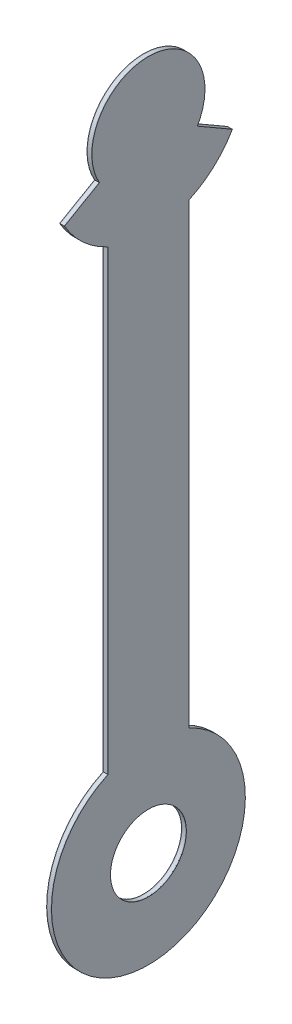
ISO-10303-21;
HEADER;
FILE_DESCRIPTION(('STEP AP214'),'2;1');
FILE_NAME('part.step','',(''),(''),'','','');
FILE_SCHEMA(('AUTOMOTIVE_DESIGN { 1 0 10303 214 1 1 1 1 }'));
ENDSEC;
DATA;
#1=APPLICATION_CONTEXT('core data for automotive mechanical design processes');
#2=APPLICATION_PROTOCOL_DEFINITION('international standard','automotive_design',2000,#1);
#3=PRODUCT_CONTEXT('',#1,'mechanical');
#4=PRODUCT('Part','Part','',(#3));
#5=PRODUCT_RELATED_PRODUCT_CATEGORY('part','',(#4));
#6=PRODUCT_DEFINITION_FORMATION('','',#4);
#7=PRODUCT_DEFINITION_CONTEXT('part definition',#1,'design');
#8=PRODUCT_DEFINITION('design','',#6,#7);
#9=PRODUCT_DEFINITION_SHAPE('','',#8);
#10=(LENGTH_UNIT() NAMED_UNIT(*) SI_UNIT(.MILLI.,.METRE.));
#11=(NAMED_UNIT(*) PLANE_ANGLE_UNIT() SI_UNIT($,.RADIAN.));
#12=(NAMED_UNIT(*) SI_UNIT($,.STERADIAN.) SOLID_ANGLE_UNIT());
#13=UNCERTAINTY_MEASURE_WITH_UNIT(LENGTH_MEASURE(1.E-05),#10,'distance_accuracy_value','');
#14=(GEOMETRIC_REPRESENTATION_CONTEXT(3) GLOBAL_UNCERTAINTY_ASSIGNED_CONTEXT((#13)) GLOBAL_UNIT_ASSIGNED_CONTEXT((#10,
#11,#12)) REPRESENTATION_CONTEXT('',''));
#15=CARTESIAN_POINT('',(0.,0.,0.));
#16=DIRECTION('',(0.,0.,1.));
#17=DIRECTION('',(1.,0.,0.));
#18=AXIS2_PLACEMENT_3D('',#15,#16,#17);
#19=CARTESIAN_POINT('',(-3.,0.,0.));
#20=DIRECTION('',(-1.,0.,0.));
#21=DIRECTION('',(0.,0.,1.));
#22=AXIS2_PLACEMENT_3D('',#19,#20,#21);
#23=PLANE('',#22);
#24=CARTESIAN_POINT('',(-3.,0.,0.));
#25=DIRECTION('',(-1.,0.,0.));
#26=DIRECTION('',(0.,0.,1.));
#27=AXIS2_PLACEMENT_3D('',#24,#25,#26);
#28=CIRCLE('',#27,60.);
#29=CARTESIAN_POINT('',(-3.,-54.5435605731786,25.));
#30=VERTEX_POINT('',#29);
#31=CARTESIAN_POINT('',(-3.,-29.9999999999997,51.9615242270665));
#32=VERTEX_POINT('',#31);
#33=EDGE_CURVE('E172',#30,#32,#28,.T.);
#34=ORIENTED_EDGE('',*,*,#33,.T.);
#35=DIRECTION('',(0.,0.5,-0.866025403784439));
#36=VECTOR('',#35,1.);
#37=CARTESIAN_POINT('',(-3.,-29.9999999999997,51.9615242270665));
#38=LINE('',#37,#36);
#39=CARTESIAN_POINT('',(-3.,-17.4999999999997,30.3108891324555));
#40=VERTEX_POINT('',#39);
#41=EDGE_CURVE('E120',#32,#40,#38,.T.);
#42=ORIENTED_EDGE('',*,*,#41,.T.);
#43=CARTESIAN_POINT('',(-3.,0.,0.));
#44=DIRECTION('',(-1.,0.,0.));
#45=DIRECTION('',(0.,0.,1.));
#46=AXIS2_PLACEMENT_3D('',#43,#44,#45);
#47=CIRCLE('',#46,35.);
#48=CARTESIAN_POINT('',(-3.,-17.5,-30.3108891324554));
#49=VERTEX_POINT('',#48);
#50=EDGE_CURVE('E187',#40,#49,#47,.T.);
#51=ORIENTED_EDGE('',*,*,#50,.T.);
#52=DIRECTION('',(0.,-0.500000000000001,-0.866025403784438));
#53=VECTOR('',#52,1.);
#54=CARTESIAN_POINT('',(-3.,-17.5,-30.3108891324553));
#55=LINE('',#54,#53);
#56=CARTESIAN_POINT('',(-3.,-30.0000000000001,-51.9615242270663));
#57=VERTEX_POINT('',#56);
#58=EDGE_CURVE('E200',#49,#57,#55,.T.);
#59=ORIENTED_EDGE('',*,*,#58,.T.);
#60=CARTESIAN_POINT('',(-3.,0.,0.));
#61=DIRECTION('',(-1.,0.,0.));
#62=DIRECTION('',(0.,0.,1.));
#63=AXIS2_PLACEMENT_3D('',#60,#61,#62);
#64=CIRCLE('',#63,60.);
#65=CARTESIAN_POINT('',(-3.,-54.5435605731786,-25.));
#66=VERTEX_POINT('',#65);
#67=EDGE_CURVE('E139',#57,#66,#64,.T.);
#68=ORIENTED_EDGE('',*,*,#67,.T.);
#69=DIRECTION('',(0.,-1.,0.));
#70=VECTOR('',#69,1.);
#71=CARTESIAN_POINT('',(-3.,-54.5435605731786,-25.));
#72=LINE('',#71,#70);
#73=CARTESIAN_POINT('',(-3.,-337.456439426821,-25.));
#74=VERTEX_POINT('',#73);
#75=EDGE_CURVE('E133',#66,#74,#72,.T.);
#76=ORIENTED_EDGE('',*,*,#75,.T.);
#77=CARTESIAN_POINT('',(-3.,-392.,0.));
#78=DIRECTION('',(-1.,0.,0.));
#79=DIRECTION('',(0.,0.,1.));
#80=AXIS2_PLACEMENT_3D('',#77,#78,#79);
#81=CIRCLE('',#80,60.);
#82=CARTESIAN_POINT('',(-3.,-337.456439426821,25.));
#83=VERTEX_POINT('',#82);
#84=EDGE_CURVE('E137',#74,#83,#81,.T.);
#85=ORIENTED_EDGE('',*,*,#84,.T.);
#86=DIRECTION('',(0.,1.,0.));
#87=VECTOR('',#86,1.);
#88=CARTESIAN_POINT('',(-3.,-337.456439426821,25.));
#89=LINE('',#88,#87);
#90=EDGE_CURVE('E77',#83,#30,#89,.T.);
#91=ORIENTED_EDGE('',*,*,#90,.T.);
#92=EDGE_LOOP('',(#34,#42,#51,#59,#68,#76,#85,#91));
#93=FACE_BOUND('',#92,.T.);
#94=CARTESIAN_POINT('',(-3.,-392.,0.));
#95=DIRECTION('',(-1.,0.,0.));
#96=DIRECTION('',(0.,0.,1.));
#97=AXIS2_PLACEMENT_3D('',#94,#95,#96);
#98=CIRCLE('',#97,23.5);
#99=CARTESIAN_POINT('',(-3.,-392.,23.5));
#100=VERTEX_POINT('',#99);
#101=EDGE_CURVE('E161',#100,#100,#98,.T.);
#102=ORIENTED_EDGE('',*,*,#101,.F.);
#103=EDGE_LOOP('',(#102));
#104=FACE_BOUND('',#103,.T.);
#105=ADVANCED_FACE('F60',(#93,#104),#23,.T.);
#106=CARTESIAN_POINT('',(-2.75,0.,0.));
#107=DIRECTION('',(-1.,0.,0.));
#108=DIRECTION('',(0.,0.,1.));
#109=AXIS2_PLACEMENT_3D('',#106,#107,#108);
#110=PLANE('',#109);
#111=CARTESIAN_POINT('',(-2.75,0.,0.));
#112=DIRECTION('',(-1.,0.,0.));
#113=DIRECTION('',(0.,0.,1.));
#114=AXIS2_PLACEMENT_3D('',#111,#112,#113);
#115=CIRCLE('',#114,60.);
#116=CARTESIAN_POINT('',(-2.75,-54.5435605731786,25.));
#117=VERTEX_POINT('',#116);
#118=CARTESIAN_POINT('',(-2.75,-29.9999999999997,51.9615242270665));
#119=VERTEX_POINT('',#118);
#120=EDGE_CURVE('E157',#117,#119,#115,.T.);
#121=ORIENTED_EDGE('',*,*,#120,.F.);
#122=DIRECTION('',(0.,1.,0.));
#123=VECTOR('',#122,1.);
#124=CARTESIAN_POINT('',(-2.75,-337.456439426821,25.));
#125=LINE('',#124,#123);
#126=CARTESIAN_POINT('',(-2.75,-337.456439426821,25.));
#127=VERTEX_POINT('',#126);
#128=EDGE_CURVE('E112',#127,#117,#125,.T.);
#129=ORIENTED_EDGE('',*,*,#128,.F.);
#130=CARTESIAN_POINT('',(-2.75,-392.,0.));
#131=DIRECTION('',(-1.,0.,0.));
#132=DIRECTION('',(0.,0.,1.));
#133=AXIS2_PLACEMENT_3D('',#130,#131,#132);
#134=CIRCLE('',#133,60.);
#135=CARTESIAN_POINT('',(-2.75,-337.456439426821,-25.));
#136=VERTEX_POINT('',#135);
#137=EDGE_CURVE('E106',#136,#127,#134,.T.);
#138=ORIENTED_EDGE('',*,*,#137,.F.);
#139=DIRECTION('',(0.,-1.,0.));
#140=VECTOR('',#139,1.);
#141=CARTESIAN_POINT('',(-2.75,-54.5435605731786,-25.));
#142=LINE('',#141,#140);
#143=CARTESIAN_POINT('',(-2.75,-54.5435605731786,-25.));
#144=VERTEX_POINT('',#143);
#145=EDGE_CURVE('E147',#144,#136,#142,.T.);
#146=ORIENTED_EDGE('',*,*,#145,.F.);
#147=CARTESIAN_POINT('',(-2.75,0.,0.));
#148=DIRECTION('',(-1.,0.,0.));
#149=DIRECTION('',(0.,0.,1.));
#150=AXIS2_PLACEMENT_3D('',#147,#148,#149);
#151=CIRCLE('',#150,60.);
#152=CARTESIAN_POINT('',(-2.75,-30.0000000000001,-51.9615242270663));
#153=VERTEX_POINT('',#152);
#154=EDGE_CURVE('E167',#153,#144,#151,.T.);
#155=ORIENTED_EDGE('',*,*,#154,.F.);
#156=DIRECTION('',(0.,-0.500000000000001,-0.866025403784438));
#157=VECTOR('',#156,1.);
#158=CARTESIAN_POINT('',(-2.75,-17.5,-30.3108891324553));
#159=LINE('',#158,#157);
#160=CARTESIAN_POINT('',(-2.75,-17.5,-30.3108891324554));
#161=VERTEX_POINT('',#160);
#162=EDGE_CURVE('E165',#161,#153,#159,.T.);
#163=ORIENTED_EDGE('',*,*,#162,.F.);
#164=CARTESIAN_POINT('',(-2.75,0.,0.));
#165=DIRECTION('',(-1.,0.,0.));
#166=DIRECTION('',(0.,0.,1.));
#167=AXIS2_PLACEMENT_3D('',#164,#165,#166);
#168=CIRCLE('',#167,35.);
#169=CARTESIAN_POINT('',(-2.75,-17.4999999999997,30.3108891324555));
#170=VERTEX_POINT('',#169);
#171=EDGE_CURVE('E163',#170,#161,#168,.T.);
#172=ORIENTED_EDGE('',*,*,#171,.F.);
#173=DIRECTION('',(0.,0.5,-0.866025403784439));
#174=VECTOR('',#173,1.);
#175=CARTESIAN_POINT('',(-2.75,-29.9999999999997,51.9615242270665));
#176=LINE('',#175,#174);
#177=EDGE_CURVE('E160',#119,#170,#176,.T.);
#178=ORIENTED_EDGE('',*,*,#177,.F.);
#179=EDGE_LOOP('',(#121,#129,#138,#146,#155,#163,#172,#178));
#180=FACE_BOUND('',#179,.T.);
#181=CARTESIAN_POINT('',(-2.75,-392.,0.));
#182=DIRECTION('',(-1.,0.,0.));
#183=DIRECTION('',(0.,0.,1.));
#184=AXIS2_PLACEMENT_3D('',#181,#182,#183);
#185=CIRCLE('',#184,23.5);
#186=CARTESIAN_POINT('',(-2.75,-392.,23.5));
#187=VERTEX_POINT('',#186);
#188=EDGE_CURVE('E206',#187,#187,#185,.T.);
#189=ORIENTED_EDGE('',*,*,#188,.T.);
#190=EDGE_LOOP('',(#189));
#191=FACE_BOUND('',#190,.T.);
#192=ADVANCED_FACE('F191',(#180,#191),#110,.F.);
#193=CARTESIAN_POINT('',(-3.,0.,0.));
#194=DIRECTION('',(1.,0.,0.));
#195=DIRECTION('',(0.,0.,-1.));
#196=AXIS2_PLACEMENT_3D('',#193,#194,#195);
#197=CYLINDRICAL_SURFACE('',#196,60.);
#198=ORIENTED_EDGE('',*,*,#120,.T.);
#199=DIRECTION('',(1.,0.,0.));
#200=VECTOR('',#199,1.);
#201=CARTESIAN_POINT('',(-3.,-29.9999999999997,51.9615242270665));
#202=LINE('',#201,#200);
#203=EDGE_CURVE('E12',#32,#119,#202,.T.);
#204=ORIENTED_EDGE('',*,*,#203,.F.);
#205=ORIENTED_EDGE('',*,*,#33,.F.);
#206=DIRECTION('',(1.,0.,0.));
#207=VECTOR('',#206,1.);
#208=CARTESIAN_POINT('',(-3.,-54.5435605731786,25.));
#209=LINE('',#208,#207);
#210=EDGE_CURVE('E153',#30,#117,#209,.T.);
#211=ORIENTED_EDGE('',*,*,#210,.T.);
#212=EDGE_LOOP('',(#198,#204,#205,#211));
#213=FACE_BOUND('',#212,.T.);
#214=ADVANCED_FACE('F62',(#213),#197,.T.);
#215=CARTESIAN_POINT('',(-3.,-29.9999999999997,51.9615242270665));
#216=DIRECTION('',(0.,-0.866025403784439,-0.5));
#217=DIRECTION('',(0.,0.5,-0.866025403784439));
#218=AXIS2_PLACEMENT_3D('',#215,#216,#217);
#219=PLANE('',#218);
#220=ORIENTED_EDGE('',*,*,#177,.T.);
#221=DIRECTION('',(1.,0.,0.));
#222=VECTOR('',#221,1.);
#223=CARTESIAN_POINT('',(-3.,-17.4999999999997,30.3108891324555));
#224=LINE('',#223,#222);
#225=EDGE_CURVE('E69',#40,#170,#224,.T.);
#226=ORIENTED_EDGE('',*,*,#225,.F.);
#227=ORIENTED_EDGE('',*,*,#41,.F.);
#228=ORIENTED_EDGE('',*,*,#203,.T.);
#229=EDGE_LOOP('',(#220,#226,#227,#228));
#230=FACE_BOUND('',#229,.T.);
#231=ADVANCED_FACE('F234',(#230),#219,.F.);
#232=CARTESIAN_POINT('',(-3.,0.,0.));
#233=DIRECTION('',(1.,0.,0.));
#234=DIRECTION('',(0.,0.,-1.));
#235=AXIS2_PLACEMENT_3D('',#232,#233,#234);
#236=CYLINDRICAL_SURFACE('',#235,35.);
#237=ORIENTED_EDGE('',*,*,#171,.T.);
#238=DIRECTION('',(1.,0.,0.));
#239=VECTOR('',#238,1.);
#240=CARTESIAN_POINT('',(-3.,-17.5,-30.3108891324554));
#241=LINE('',#240,#239);
#242=EDGE_CURVE('E179',#49,#161,#241,.T.);
#243=ORIENTED_EDGE('',*,*,#242,.F.);
#244=ORIENTED_EDGE('',*,*,#50,.F.);
#245=ORIENTED_EDGE('',*,*,#225,.T.);
#246=EDGE_LOOP('',(#237,#243,#244,#245));
#247=FACE_BOUND('',#246,.T.);
#248=ADVANCED_FACE('F185',(#247),#236,.T.);
#249=CARTESIAN_POINT('',(-3.,-17.5,-30.3108891324553));
#250=DIRECTION('',(0.,-0.866025403784438,0.500000000000001));
#251=DIRECTION('',(0.,-0.500000000000001,-0.866025403784438));
#252=AXIS2_PLACEMENT_3D('',#249,#250,#251);
#253=PLANE('',#252);
#254=ORIENTED_EDGE('',*,*,#162,.T.);
#255=DIRECTION('',(1.,0.,0.));
#256=VECTOR('',#255,1.);
#257=CARTESIAN_POINT('',(-3.,-30.0000000000001,-51.9615242270663));
#258=LINE('',#257,#256);
#259=EDGE_CURVE('E176',#57,#153,#258,.T.);
#260=ORIENTED_EDGE('',*,*,#259,.F.);
#261=ORIENTED_EDGE('',*,*,#58,.F.);
#262=ORIENTED_EDGE('',*,*,#242,.T.);
#263=EDGE_LOOP('',(#254,#260,#261,#262));
#264=FACE_BOUND('',#263,.T.);
#265=ADVANCED_FACE('F196',(#264),#253,.F.);
#266=CARTESIAN_POINT('',(-3.,0.,0.));
#267=DIRECTION('',(1.,0.,0.));
#268=DIRECTION('',(0.,0.,-1.));
#269=AXIS2_PLACEMENT_3D('',#266,#267,#268);
#270=CYLINDRICAL_SURFACE('',#269,60.);
#271=ORIENTED_EDGE('',*,*,#154,.T.);
#272=DIRECTION('',(1.,0.,0.));
#273=VECTOR('',#272,1.);
#274=CARTESIAN_POINT('',(-3.,-54.5435605731786,-25.));
#275=LINE('',#274,#273);
#276=EDGE_CURVE('E148',#66,#144,#275,.T.);
#277=ORIENTED_EDGE('',*,*,#276,.F.);
#278=ORIENTED_EDGE('',*,*,#67,.F.);
#279=ORIENTED_EDGE('',*,*,#259,.T.);
#280=EDGE_LOOP('',(#271,#277,#278,#279));
#281=FACE_BOUND('',#280,.T.);
#282=ADVANCED_FACE('F199',(#281),#270,.T.);
#283=CARTESIAN_POINT('',(-3.,-54.5435605731786,-25.));
#284=DIRECTION('',(0.,0.,1.));
#285=DIRECTION('',(0.,-1.,0.));
#286=AXIS2_PLACEMENT_3D('',#283,#284,#285);
#287=PLANE('',#286);
#288=ORIENTED_EDGE('',*,*,#145,.T.);
#289=DIRECTION('',(1.,0.,0.));
#290=VECTOR('',#289,1.);
#291=CARTESIAN_POINT('',(-3.,-337.456439426821,-25.));
#292=LINE('',#291,#290);
#293=EDGE_CURVE('E144',#74,#136,#292,.T.);
#294=ORIENTED_EDGE('',*,*,#293,.F.);
#295=ORIENTED_EDGE('',*,*,#75,.F.);
#296=ORIENTED_EDGE('',*,*,#276,.T.);
#297=EDGE_LOOP('',(#288,#294,#295,#296));
#298=FACE_BOUND('',#297,.T.);
#299=ADVANCED_FACE('F145',(#298),#287,.F.);
#300=CARTESIAN_POINT('',(-3.,-392.,0.));
#301=DIRECTION('',(1.,0.,0.));
#302=DIRECTION('',(0.,0.,-1.));
#303=AXIS2_PLACEMENT_3D('',#300,#301,#302);
#304=CYLINDRICAL_SURFACE('',#303,60.);
#305=ORIENTED_EDGE('',*,*,#137,.T.);
#306=DIRECTION('',(1.,0.,0.));
#307=VECTOR('',#306,1.);
#308=CARTESIAN_POINT('',(-3.,-337.456439426821,25.));
#309=LINE('',#308,#307);
#310=EDGE_CURVE('E149',#83,#127,#309,.T.);
#311=ORIENTED_EDGE('',*,*,#310,.F.);
#312=ORIENTED_EDGE('',*,*,#84,.F.);
#313=ORIENTED_EDGE('',*,*,#293,.T.);
#314=EDGE_LOOP('',(#305,#311,#312,#313));
#315=FACE_BOUND('',#314,.T.);
#316=ADVANCED_FACE('F151',(#315),#304,.T.);
#317=CARTESIAN_POINT('',(-3.,-337.456439426821,25.));
#318=DIRECTION('',(0.,0.,-1.));
#319=DIRECTION('',(0.,1.,0.));
#320=AXIS2_PLACEMENT_3D('',#317,#318,#319);
#321=PLANE('',#320);
#322=ORIENTED_EDGE('',*,*,#128,.T.);
#323=ORIENTED_EDGE('',*,*,#210,.F.);
#324=ORIENTED_EDGE('',*,*,#90,.F.);
#325=ORIENTED_EDGE('',*,*,#310,.T.);
#326=EDGE_LOOP('',(#322,#323,#324,#325));
#327=FACE_BOUND('',#326,.T.);
#328=ADVANCED_FACE('F222',(#327),#321,.F.);
#329=CARTESIAN_POINT('',(-3.,-392.,0.));
#330=DIRECTION('',(1.,0.,0.));
#331=DIRECTION('',(0.,0.,-1.));
#332=AXIS2_PLACEMENT_3D('',#329,#330,#331);
#333=CYLINDRICAL_SURFACE('',#332,23.5);
#334=ORIENTED_EDGE('',*,*,#101,.T.);
#335=EDGE_LOOP('',(#334));
#336=FACE_BOUND('',#335,.T.);
#337=ORIENTED_EDGE('',*,*,#188,.F.);
#338=EDGE_LOOP('',(#337));
#339=FACE_BOUND('',#338,.T.);
#340=ADVANCED_FACE('F212',(#336,#339),#333,.F.);
#341=CLOSED_SHELL('',(#105,#192,#214,#231,#248,#265,#282,#299,#316,#328,#340));
#342=MANIFOLD_SOLID_BREP('B2',#341);
#343=CARTESIAN_POINT('',(-2.75,2.98960605148695E-13,1.72604985859692E-13));
#344=DIRECTION('',(0.,-0.866025403784439,-0.5));
#345=DIRECTION('',(0.,0.5,-0.866025403784439));
#346=AXIS2_PLACEMENT_3D('',#343,#344,#345);
#347=PLANE('',#346);
#348=DIRECTION('',(0.,0.5,-0.866025403784439));
#349=VECTOR('',#348,1.);
#350=CARTESIAN_POINT('',(-0.25,2.98960605148695E-13,1.72604985859692E-13));
#351=LINE('',#350,#349);
#352=CARTESIAN_POINT('',(-0.25,-29.9999999999997,51.9615242270665));
#353=VERTEX_POINT('',#352);
#354=CARTESIAN_POINT('',(-0.25,-17.4999999999997,30.3108891324555));
#355=VERTEX_POINT('',#354);
#356=EDGE_CURVE('E424',#353,#355,#351,.T.);
#357=ORIENTED_EDGE('',*,*,#356,.T.);
#358=DIRECTION('',(1.,0.,0.));
#359=VECTOR('',#358,1.);
#360=CARTESIAN_POINT('',(-2.75,-17.4999999999997,30.3108891324555));
#361=LINE('',#360,#359);
#362=CARTESIAN_POINT('',(-2.75,-17.4999999999997,30.3108891324555));
#363=VERTEX_POINT('',#362);
#364=EDGE_CURVE('E58',#363,#355,#361,.T.);
#365=ORIENTED_EDGE('',*,*,#364,.F.);
#366=DIRECTION('',(0.,0.5,-0.866025403784439));
#367=VECTOR('',#366,1.);
#368=CARTESIAN_POINT('',(-2.75,2.98960605148695E-13,1.72604985859692E-13));
#369=LINE('',#368,#367);
#370=CARTESIAN_POINT('',(-2.75,-29.9999999999997,51.9615242270665));
#371=VERTEX_POINT('',#370);
#372=EDGE_CURVE('E488',#371,#363,#369,.T.);
#373=ORIENTED_EDGE('',*,*,#372,.F.);
#374=DIRECTION('',(1.,0.,0.));
#375=VECTOR('',#374,1.);
#376=CARTESIAN_POINT('',(-2.75,-29.9999999999997,51.9615242270665));
#377=LINE('',#376,#375);
#378=EDGE_CURVE('E416',#371,#353,#377,.T.);
#379=ORIENTED_EDGE('',*,*,#378,.T.);
#380=EDGE_LOOP('',(#357,#365,#373,#379));
#381=FACE_BOUND('',#380,.T.);
#382=ADVANCED_FACE('F318',(#381),#347,.F.);
#383=CARTESIAN_POINT('',(-2.75,0.,0.));
#384=DIRECTION('',(1.,0.,0.));
#385=DIRECTION('',(0.,0.,-1.));
#386=AXIS2_PLACEMENT_3D('',#383,#384,#385);
#387=CYLINDRICAL_SURFACE('',#386,35.);
#388=CARTESIAN_POINT('',(-0.25,0.,0.));
#389=DIRECTION('',(-1.,0.,0.));
#390=DIRECTION('',(0.,0.,1.));
#391=AXIS2_PLACEMENT_3D('',#388,#389,#390);
#392=CIRCLE('',#391,35.);
#393=CARTESIAN_POINT('',(-0.25,-17.5,-30.3108891324553));
#394=VERTEX_POINT('',#393);
#395=EDGE_CURVE('E428',#355,#394,#392,.T.);
#396=ORIENTED_EDGE('',*,*,#395,.T.);
#397=DIRECTION('',(1.,0.,0.));
#398=VECTOR('',#397,1.);
#399=CARTESIAN_POINT('',(-2.75,-17.5,-30.3108891324553));
#400=LINE('',#399,#398);
#401=CARTESIAN_POINT('',(-2.75,-17.5,-30.3108891324553));
#402=VERTEX_POINT('',#401);
#403=EDGE_CURVE('E328',#402,#394,#400,.T.);
#404=ORIENTED_EDGE('',*,*,#403,.F.);
#405=CARTESIAN_POINT('',(-2.75,0.,0.));
#406=DIRECTION('',(-1.,0.,0.));
#407=DIRECTION('',(0.,0.,1.));
#408=AXIS2_PLACEMENT_3D('',#405,#406,#407);
#409=CIRCLE('',#408,35.);
#410=EDGE_CURVE('E379',#363,#402,#409,.T.);
#411=ORIENTED_EDGE('',*,*,#410,.F.);
#412=ORIENTED_EDGE('',*,*,#364,.T.);
#413=EDGE_LOOP('',(#396,#404,#411,#412));
#414=FACE_BOUND('',#413,.T.);
#415=ADVANCED_FACE('F509',(#414),#387,.T.);
#416=CARTESIAN_POINT('',(-2.75,0.,0.));
#417=DIRECTION('',(0.,-0.866025403784438,0.500000000000001));
#418=DIRECTION('',(0.,-0.500000000000001,-0.866025403784438));
#419=AXIS2_PLACEMENT_3D('',#416,#417,#418);
#420=PLANE('',#419);
#421=DIRECTION('',(0.,-0.500000000000001,-0.866025403784438));
#422=VECTOR('',#421,1.);
#423=CARTESIAN_POINT('',(-0.25,0.,0.));
#424=LINE('',#423,#422);
#425=CARTESIAN_POINT('',(-0.25,-30.0000000000001,-51.9615242270663));
#426=VERTEX_POINT('',#425);
#427=EDGE_CURVE('E431',#394,#426,#424,.T.);
#428=ORIENTED_EDGE('',*,*,#427,.T.);
#429=DIRECTION('',(1.,0.,0.));
#430=VECTOR('',#429,1.);
#431=CARTESIAN_POINT('',(-2.75,-30.0000000000001,-51.9615242270663));
#432=LINE('',#431,#430);
#433=CARTESIAN_POINT('',(-2.75,-30.0000000000001,-51.9615242270663));
#434=VERTEX_POINT('',#433);
#435=EDGE_CURVE('E457',#434,#426,#432,.T.);
#436=ORIENTED_EDGE('',*,*,#435,.F.);
#437=DIRECTION('',(0.,-0.500000000000001,-0.866025403784438));
#438=VECTOR('',#437,1.);
#439=CARTESIAN_POINT('',(-2.75,0.,0.));
#440=LINE('',#439,#438);
#441=EDGE_CURVE('E467',#402,#434,#440,.T.);
#442=ORIENTED_EDGE('',*,*,#441,.F.);
#443=ORIENTED_EDGE('',*,*,#403,.T.);
#444=EDGE_LOOP('',(#428,#436,#442,#443));
#445=FACE_BOUND('',#444,.T.);
#446=ADVANCED_FACE('F465',(#445),#420,.F.);
#447=CARTESIAN_POINT('',(-2.75,0.,0.));
#448=DIRECTION('',(1.,0.,0.));
#449=DIRECTION('',(0.,0.,-1.));
#450=AXIS2_PLACEMENT_3D('',#447,#448,#449);
#451=CYLINDRICAL_SURFACE('',#450,60.);
#452=CARTESIAN_POINT('',(-0.25,0.,0.));
#453=DIRECTION('',(-1.,0.,0.));
#454=DIRECTION('',(0.,0.,1.));
#455=AXIS2_PLACEMENT_3D('',#452,#453,#454);
#456=CIRCLE('',#455,60.);
#457=CARTESIAN_POINT('',(-0.25,-54.5435605731786,-25.));
#458=VERTEX_POINT('',#457);
#459=EDGE_CURVE('E434',#426,#458,#456,.T.);
#460=ORIENTED_EDGE('',*,*,#459,.T.);
#461=DIRECTION('',(1.,0.,0.));
#462=VECTOR('',#461,1.);
#463=CARTESIAN_POINT('',(-2.75,-54.5435605731786,-25.));
#464=LINE('',#463,#462);
#465=CARTESIAN_POINT('',(-2.75,-54.5435605731786,-25.));
#466=VERTEX_POINT('',#465);
#467=EDGE_CURVE('E453',#466,#458,#464,.T.);
#468=ORIENTED_EDGE('',*,*,#467,.F.);
#469=CARTESIAN_POINT('',(-2.75,0.,0.));
#470=DIRECTION('',(-1.,0.,0.));
#471=DIRECTION('',(0.,0.,1.));
#472=AXIS2_PLACEMENT_3D('',#469,#470,#471);
#473=CIRCLE('',#472,60.);
#474=EDGE_CURVE('E480',#434,#466,#473,.T.);
#475=ORIENTED_EDGE('',*,*,#474,.F.);
#476=ORIENTED_EDGE('',*,*,#435,.T.);
#477=EDGE_LOOP('',(#460,#468,#475,#476));
#478=FACE_BOUND('',#477,.T.);
#479=ADVANCED_FACE('F475',(#478),#451,.T.);
#480=CARTESIAN_POINT('',(-2.75,0.,-25.));
#481=DIRECTION('',(0.,0.,1.));
#482=DIRECTION('',(1.,0.,0.));
#483=AXIS2_PLACEMENT_3D('',#480,#481,#482);
#484=PLANE('',#483);
#485=DIRECTION('',(0.,-1.,0.));
#486=VECTOR('',#485,1.);
#487=CARTESIAN_POINT('',(-0.25,0.,-25.));
#488=LINE('',#487,#486);
#489=CARTESIAN_POINT('',(-0.25,-337.456439426821,-25.));
#490=VERTEX_POINT('',#489);
#491=EDGE_CURVE('E437',#458,#490,#488,.T.);
#492=ORIENTED_EDGE('',*,*,#491,.T.);
#493=DIRECTION('',(1.,0.,0.));
#494=VECTOR('',#493,1.);
#495=CARTESIAN_POINT('',(-2.75,-337.456439426821,-25.));
#496=LINE('',#495,#494);
#497=CARTESIAN_POINT('',(-2.75,-337.456439426821,-25.));
#498=VERTEX_POINT('',#497);
#499=EDGE_CURVE('E409',#498,#490,#496,.T.);
#500=ORIENTED_EDGE('',*,*,#499,.F.);
#501=DIRECTION('',(0.,-1.,0.));
#502=VECTOR('',#501,1.);
#503=CARTESIAN_POINT('',(-2.75,0.,-25.));
#504=LINE('',#503,#502);
#505=EDGE_CURVE('E398',#466,#498,#504,.T.);
#506=ORIENTED_EDGE('',*,*,#505,.F.);
#507=ORIENTED_EDGE('',*,*,#467,.T.);
#508=EDGE_LOOP('',(#492,#500,#506,#507));
#509=FACE_BOUND('',#508,.T.);
#510=ADVANCED_FACE('F478',(#509),#484,.F.);
#511=CARTESIAN_POINT('',(-2.75,-392.,0.));
#512=DIRECTION('',(1.,0.,0.));
#513=DIRECTION('',(0.,0.,-1.));
#514=AXIS2_PLACEMENT_3D('',#511,#512,#513);
#515=CYLINDRICAL_SURFACE('',#514,60.);
#516=CARTESIAN_POINT('',(-0.25,-392.,0.));
#517=DIRECTION('',(-1.,0.,0.));
#518=DIRECTION('',(0.,0.,1.));
#519=AXIS2_PLACEMENT_3D('',#516,#517,#518);
#520=CIRCLE('',#519,60.);
#521=CARTESIAN_POINT('',(-0.25,-337.456439426821,25.));
#522=VERTEX_POINT('',#521);
#523=EDGE_CURVE('E407',#490,#522,#520,.T.);
#524=ORIENTED_EDGE('',*,*,#523,.T.);
#525=DIRECTION('',(1.,0.,0.));
#526=VECTOR('',#525,1.);
#527=CARTESIAN_POINT('',(-2.75,-337.456439426821,25.));
#528=LINE('',#527,#526);
#529=CARTESIAN_POINT('',(-2.75,-337.456439426821,25.));
#530=VERTEX_POINT('',#529);
#531=EDGE_CURVE('E404',#530,#522,#528,.T.);
#532=ORIENTED_EDGE('',*,*,#531,.F.);
#533=CARTESIAN_POINT('',(-2.75,-392.,0.));
#534=DIRECTION('',(-1.,0.,0.));
#535=DIRECTION('',(0.,0.,1.));
#536=AXIS2_PLACEMENT_3D('',#533,#534,#535);
#537=CIRCLE('',#536,60.);
#538=EDGE_CURVE('E392',#498,#530,#537,.T.);
#539=ORIENTED_EDGE('',*,*,#538,.F.);
#540=ORIENTED_EDGE('',*,*,#499,.T.);
#541=EDGE_LOOP('',(#524,#532,#539,#540));
#542=FACE_BOUND('',#541,.T.);
#543=ADVANCED_FACE('F405',(#542),#515,.T.);
#544=CARTESIAN_POINT('',(-2.75,0.,25.));
#545=DIRECTION('',(0.,0.,-1.));
#546=DIRECTION('',(-1.,0.,0.));
#547=AXIS2_PLACEMENT_3D('',#544,#545,#546);
#548=PLANE('',#547);
#549=DIRECTION('',(0.,1.,0.));
#550=VECTOR('',#549,1.);
#551=CARTESIAN_POINT('',(-0.25,0.,25.));
#552=LINE('',#551,#550);
#553=CARTESIAN_POINT('',(-0.25,-54.5435605731786,25.));
#554=VERTEX_POINT('',#553);
#555=EDGE_CURVE('E365',#522,#554,#552,.T.);
#556=ORIENTED_EDGE('',*,*,#555,.T.);
#557=DIRECTION('',(1.,0.,0.));
#558=VECTOR('',#557,1.);
#559=CARTESIAN_POINT('',(-2.75,-54.5435605731786,25.));
#560=LINE('',#559,#558);
#561=CARTESIAN_POINT('',(-2.75,-54.5435605731786,25.));
#562=VERTEX_POINT('',#561);
#563=EDGE_CURVE('E410',#562,#554,#560,.T.);
#564=ORIENTED_EDGE('',*,*,#563,.F.);
#565=DIRECTION('',(0.,1.,0.));
#566=VECTOR('',#565,1.);
#567=CARTESIAN_POINT('',(-2.75,0.,25.));
#568=LINE('',#567,#566);
#569=EDGE_CURVE('E396',#530,#562,#568,.T.);
#570=ORIENTED_EDGE('',*,*,#569,.F.);
#571=ORIENTED_EDGE('',*,*,#531,.T.);
#572=EDGE_LOOP('',(#556,#564,#570,#571));
#573=FACE_BOUND('',#572,.T.);
#574=ADVANCED_FACE('F412',(#573),#548,.F.);
#575=CARTESIAN_POINT('',(-2.75,-392.,0.));
#576=DIRECTION('',(1.,0.,0.));
#577=DIRECTION('',(0.,0.,-1.));
#578=AXIS2_PLACEMENT_3D('',#575,#576,#577);
#579=CYLINDRICAL_SURFACE('',#578,23.5);
#580=CARTESIAN_POINT('',(-2.75,-392.,0.));
#581=DIRECTION('',(-1.,0.,0.));
#582=DIRECTION('',(0.,0.,1.));
#583=AXIS2_PLACEMENT_3D('',#580,#581,#582);
#584=CIRCLE('',#583,23.5);
#585=CARTESIAN_POINT('',(-2.75,-392.,23.5));
#586=VERTEX_POINT('',#585);
#587=EDGE_CURVE('E446',#586,#586,#584,.F.);
#588=ORIENTED_EDGE('',*,*,#587,.F.);
#589=EDGE_LOOP('',(#588));
#590=FACE_BOUND('',#589,.T.);
#591=CARTESIAN_POINT('',(-0.25,-392.,0.));
#592=DIRECTION('',(-1.,0.,0.));
#593=DIRECTION('',(0.,0.,1.));
#594=AXIS2_PLACEMENT_3D('',#591,#592,#593);
#595=CIRCLE('',#594,23.5);
#596=CARTESIAN_POINT('',(-0.25,-392.,23.5));
#597=VERTEX_POINT('',#596);
#598=EDGE_CURVE('E420',#597,#597,#595,.F.);
#599=ORIENTED_EDGE('',*,*,#598,.T.);
#600=EDGE_LOOP('',(#599));
#601=FACE_BOUND('',#600,.T.);
#602=ADVANCED_FACE('F320',(#590,#601),#579,.F.);
#603=CARTESIAN_POINT('',(-2.75,0.,0.));
#604=DIRECTION('',(1.,0.,0.));
#605=DIRECTION('',(0.,0.,-1.));
#606=AXIS2_PLACEMENT_3D('',#603,#604,#605);
#607=CYLINDRICAL_SURFACE('',#606,60.);
#608=CARTESIAN_POINT('',(-0.25,0.,0.));
#609=DIRECTION('',(-1.,0.,0.));
#610=DIRECTION('',(0.,0.,1.));
#611=AXIS2_PLACEMENT_3D('',#608,#609,#610);
#612=CIRCLE('',#611,60.);
#613=EDGE_CURVE('E371',#554,#353,#612,.T.);
#614=ORIENTED_EDGE('',*,*,#613,.T.);
#615=ORIENTED_EDGE('',*,*,#378,.F.);
#616=CARTESIAN_POINT('',(-2.75,0.,0.));
#617=DIRECTION('',(-1.,0.,0.));
#618=DIRECTION('',(0.,0.,1.));
#619=AXIS2_PLACEMENT_3D('',#616,#617,#618);
#620=CIRCLE('',#619,60.);
#621=EDGE_CURVE('E336',#562,#371,#620,.T.);
#622=ORIENTED_EDGE('',*,*,#621,.F.);
#623=ORIENTED_EDGE('',*,*,#563,.T.);
#624=EDGE_LOOP('',(#614,#615,#622,#623));
#625=FACE_BOUND('',#624,.T.);
#626=ADVANCED_FACE('F498',(#625),#607,.T.);
#627=CARTESIAN_POINT('',(-2.75,0.,0.));
#628=DIRECTION('',(-1.,0.,0.));
#629=DIRECTION('',(0.,0.,1.));
#630=AXIS2_PLACEMENT_3D('',#627,#628,#629);
#631=PLANE('',#630);
#632=ORIENTED_EDGE('',*,*,#587,.T.);
#633=EDGE_LOOP('',(#632));
#634=FACE_BOUND('',#633,.T.);
#635=ORIENTED_EDGE('',*,*,#372,.T.);
#636=ORIENTED_EDGE('',*,*,#410,.T.);
#637=ORIENTED_EDGE('',*,*,#441,.T.);
#638=ORIENTED_EDGE('',*,*,#474,.T.);
#639=ORIENTED_EDGE('',*,*,#505,.T.);
#640=ORIENTED_EDGE('',*,*,#538,.T.);
#641=ORIENTED_EDGE('',*,*,#569,.T.);
#642=ORIENTED_EDGE('',*,*,#621,.T.);
#643=EDGE_LOOP('',(#635,#636,#637,#638,#639,#640,#641,#642));
#644=FACE_BOUND('',#643,.T.);
#645=ADVANCED_FACE('F394',(#634,#644),#631,.T.);
#646=CARTESIAN_POINT('',(-0.25,0.,0.));
#647=DIRECTION('',(-1.,0.,0.));
#648=DIRECTION('',(0.,0.,1.));
#649=AXIS2_PLACEMENT_3D('',#646,#647,#648);
#650=PLANE('',#649);
#651=ORIENTED_EDGE('',*,*,#598,.F.);
#652=EDGE_LOOP('',(#651));
#653=FACE_BOUND('',#652,.T.);
#654=ORIENTED_EDGE('',*,*,#356,.F.);
#655=ORIENTED_EDGE('',*,*,#613,.F.);
#656=ORIENTED_EDGE('',*,*,#555,.F.);
#657=ORIENTED_EDGE('',*,*,#523,.F.);
#658=ORIENTED_EDGE('',*,*,#491,.F.);
#659=ORIENTED_EDGE('',*,*,#459,.F.);
#660=ORIENTED_EDGE('',*,*,#427,.F.);
#661=ORIENTED_EDGE('',*,*,#395,.F.);
#662=EDGE_LOOP('',(#654,#655,#656,#657,#658,#659,#660,#661));
#663=FACE_BOUND('',#662,.T.);
#664=ADVANCED_FACE('F471',(#653,#663),#650,.F.);
#665=CLOSED_SHELL('',(#382,#415,#446,#479,#510,#543,#574,#602,#626,#645,#664));
#666=MANIFOLD_SOLID_BREP('B6',#665);
#667=CARTESIAN_POINT('',(-0.25,0.,0.));
#668=DIRECTION('',(1.,0.,0.));
#669=DIRECTION('',(0.,0.,-1.));
#670=AXIS2_PLACEMENT_3D('',#667,#668,#669);
#671=CYLINDRICAL_SURFACE('',#670,35.);
#672=CARTESIAN_POINT('',(0.,0.,0.));
#673=DIRECTION('',(1.,0.,0.));
#674=DIRECTION('',(0.,0.,-1.));
#675=AXIS2_PLACEMENT_3D('',#672,#673,#674);
#676=CIRCLE('',#675,35.);
#677=CARTESIAN_POINT('',(0.,-17.5,-30.3108891324553));
#678=VERTEX_POINT('',#677);
#679=CARTESIAN_POINT('',(0.,-17.4999999999997,30.3108891324555));
#680=VERTEX_POINT('',#679);
#681=EDGE_CURVE('E746',#678,#680,#676,.T.);
#682=ORIENTED_EDGE('',*,*,#681,.F.);
#683=DIRECTION('',(1.,0.,0.));
#684=VECTOR('',#683,1.);
#685=CARTESIAN_POINT('',(-0.25,-17.5,-30.3108891324553));
#686=LINE('',#685,#684);
#687=CARTESIAN_POINT('',(-0.25,-17.5,-30.3108891324553));
#688=VERTEX_POINT('',#687);
#689=EDGE_CURVE('E316',#688,#678,#686,.T.);
#690=ORIENTED_EDGE('',*,*,#689,.F.);
#691=CARTESIAN_POINT('',(-0.25,0.,0.));
#692=DIRECTION('',(1.,0.,0.));
#693=DIRECTION('',(0.,0.,-1.));
#694=AXIS2_PLACEMENT_3D('',#691,#692,#693);
#695=CIRCLE('',#694,35.);
#696=CARTESIAN_POINT('',(-0.25,-17.4999999999997,30.3108891324555));
#697=VERTEX_POINT('',#696);
#698=EDGE_CURVE('E724',#688,#697,#695,.T.);
#699=ORIENTED_EDGE('',*,*,#698,.T.);
#700=DIRECTION('',(1.,0.,0.));
#701=VECTOR('',#700,1.);
#702=CARTESIAN_POINT('',(-0.25,-17.4999999999997,30.3108891324555));
#703=LINE('',#702,#701);
#704=EDGE_CURVE('E622',#697,#680,#703,.T.);
#705=ORIENTED_EDGE('',*,*,#704,.T.);
#706=EDGE_LOOP('',(#682,#690,#699,#705));
#707=FACE_BOUND('',#706,.T.);
#708=ADVANCED_FACE('F619',(#707),#671,.T.);
#709=CARTESIAN_POINT('',(-0.25,0.,0.));
#710=DIRECTION('',(0.,-0.866025403784438,0.500000000000001));
#711=DIRECTION('',(0.,-0.500000000000001,-0.866025403784438));
#712=AXIS2_PLACEMENT_3D('',#709,#710,#711);
#713=PLANE('',#712);
#714=DIRECTION('',(0.,-0.500000000000001,-0.866025403784438));
#715=VECTOR('',#714,1.);
#716=CARTESIAN_POINT('',(0.,0.,0.));
#717=LINE('',#716,#715);
#718=CARTESIAN_POINT('',(0.,-30.0000000000001,-51.9615242270663));
#719=VERTEX_POINT('',#718);
#720=EDGE_CURVE('E728',#678,#719,#717,.T.);
#721=ORIENTED_EDGE('',*,*,#720,.T.);
#722=DIRECTION('',(1.,0.,0.));
#723=VECTOR('',#722,1.);
#724=CARTESIAN_POINT('',(-0.25,-30.0000000000001,-51.9615242270663));
#725=LINE('',#724,#723);
#726=CARTESIAN_POINT('',(-0.25,-30.0000000000001,-51.9615242270663));
#727=VERTEX_POINT('',#726);
#728=EDGE_CURVE('E628',#727,#719,#725,.T.);
#729=ORIENTED_EDGE('',*,*,#728,.F.);
#730=DIRECTION('',(0.,-0.500000000000001,-0.866025403784438));
#731=VECTOR('',#730,1.);
#732=CARTESIAN_POINT('',(-0.25,0.,0.));
#733=LINE('',#732,#731);
#734=EDGE_CURVE('E711',#688,#727,#733,.T.);
#735=ORIENTED_EDGE('',*,*,#734,.F.);
#736=ORIENTED_EDGE('',*,*,#689,.T.);
#737=EDGE_LOOP('',(#721,#729,#735,#736));
#738=FACE_BOUND('',#737,.T.);
#739=ADVANCED_FACE('F785',(#738),#713,.F.);
#740=CARTESIAN_POINT('',(-0.25,0.,0.));
#741=DIRECTION('',(1.,0.,0.));
#742=DIRECTION('',(0.,0.,-1.));
#743=AXIS2_PLACEMENT_3D('',#740,#741,#742);
#744=CYLINDRICAL_SURFACE('',#743,60.);
#745=CARTESIAN_POINT('',(0.,0.,0.));
#746=DIRECTION('',(1.,0.,0.));
#747=DIRECTION('',(0.,0.,-1.));
#748=AXIS2_PLACEMENT_3D('',#745,#746,#747);
#749=CIRCLE('',#748,60.);
#750=CARTESIAN_POINT('',(0.,-54.5435605731786,-25.));
#751=VERTEX_POINT('',#750);
#752=EDGE_CURVE('E694',#751,#719,#749,.T.);
#753=ORIENTED_EDGE('',*,*,#752,.F.);
#754=DIRECTION('',(1.,0.,0.));
#755=VECTOR('',#754,1.);
#756=CARTESIAN_POINT('',(-0.25,-54.5435605731786,-25.));
#757=LINE('',#756,#755);
#758=CARTESIAN_POINT('',(-0.25,-54.5435605731786,-25.));
#759=VERTEX_POINT('',#758);
#760=EDGE_CURVE('E688',#759,#751,#757,.T.);
#761=ORIENTED_EDGE('',*,*,#760,.F.);
#762=CARTESIAN_POINT('',(-0.25,0.,0.));
#763=DIRECTION('',(1.,0.,0.));
#764=DIRECTION('',(0.,0.,-1.));
#765=AXIS2_PLACEMENT_3D('',#762,#763,#764);
#766=CIRCLE('',#765,60.);
#767=EDGE_CURVE('E692',#759,#727,#766,.T.);
#768=ORIENTED_EDGE('',*,*,#767,.T.);
#769=ORIENTED_EDGE('',*,*,#728,.T.);
#770=EDGE_LOOP('',(#753,#761,#768,#769));
#771=FACE_BOUND('',#770,.T.);
#772=ADVANCED_FACE('F690',(#771),#744,.T.);
#773=CARTESIAN_POINT('',(-0.25,0.,-25.));
#774=DIRECTION('',(0.,0.,1.));
#775=DIRECTION('',(1.,0.,0.));
#776=AXIS2_PLACEMENT_3D('',#773,#774,#775);
#777=PLANE('',#776);
#778=DIRECTION('',(0.,-1.,0.));
#779=VECTOR('',#778,1.);
#780=CARTESIAN_POINT('',(0.,0.,-25.));
#781=LINE('',#780,#779);
#782=CARTESIAN_POINT('',(0.,-337.456439426821,-25.));
#783=VERTEX_POINT('',#782);
#784=EDGE_CURVE('E760',#751,#783,#781,.T.);
#785=ORIENTED_EDGE('',*,*,#784,.T.);
#786=DIRECTION('',(1.,0.,0.));
#787=VECTOR('',#786,1.);
#788=CARTESIAN_POINT('',(-0.25,-337.456439426821,-25.));
#789=LINE('',#788,#787);
#790=CARTESIAN_POINT('',(-0.25,-337.456439426821,-25.));
#791=VERTEX_POINT('',#790);
#792=EDGE_CURVE('E698',#791,#783,#789,.T.);
#793=ORIENTED_EDGE('',*,*,#792,.F.);
#794=DIRECTION('',(0.,-1.,0.));
#795=VECTOR('',#794,1.);
#796=CARTESIAN_POINT('',(-0.25,0.,-25.));
#797=LINE('',#796,#795);
#798=EDGE_CURVE('E701',#759,#791,#797,.T.);
#799=ORIENTED_EDGE('',*,*,#798,.F.);
#800=ORIENTED_EDGE('',*,*,#760,.T.);
#801=EDGE_LOOP('',(#785,#793,#799,#800));
#802=FACE_BOUND('',#801,.T.);
#803=ADVANCED_FACE('F702',(#802),#777,.F.);
#804=CARTESIAN_POINT('',(-0.25,-392.,0.));
#805=DIRECTION('',(1.,0.,0.));
#806=DIRECTION('',(0.,0.,-1.));
#807=AXIS2_PLACEMENT_3D('',#804,#805,#806);
#808=CYLINDRICAL_SURFACE('',#807,60.);
#809=CARTESIAN_POINT('',(0.,-392.,0.));
#810=DIRECTION('',(1.,0.,0.));
#811=DIRECTION('',(0.,0.,-1.));
#812=AXIS2_PLACEMENT_3D('',#809,#810,#811);
#813=CIRCLE('',#812,60.);
#814=CARTESIAN_POINT('',(0.,-337.456439426821,25.));
#815=VERTEX_POINT('',#814);
#816=EDGE_CURVE('E758',#815,#783,#813,.T.);
#817=ORIENTED_EDGE('',*,*,#816,.F.);
#818=DIRECTION('',(1.,0.,0.));
#819=VECTOR('',#818,1.);
#820=CARTESIAN_POINT('',(-0.25,-337.456439426821,25.));
#821=LINE('',#820,#819);
#822=CARTESIAN_POINT('',(-0.25,-337.456439426821,25.));
#823=VERTEX_POINT('',#822);
#824=EDGE_CURVE('E737',#823,#815,#821,.T.);
#825=ORIENTED_EDGE('',*,*,#824,.F.);
#826=CARTESIAN_POINT('',(-0.25,-392.,0.));
#827=DIRECTION('',(1.,0.,0.));
#828=DIRECTION('',(0.,0.,-1.));
#829=AXIS2_PLACEMENT_3D('',#826,#827,#828);
#830=CIRCLE('',#829,60.);
#831=EDGE_CURVE('E706',#823,#791,#830,.T.);
#832=ORIENTED_EDGE('',*,*,#831,.T.);
#833=ORIENTED_EDGE('',*,*,#792,.T.);
#834=EDGE_LOOP('',(#817,#825,#832,#833));
#835=FACE_BOUND('',#834,.T.);
#836=ADVANCED_FACE('F767',(#835),#808,.T.);
#837=CARTESIAN_POINT('',(-0.25,0.,25.));
#838=DIRECTION('',(0.,0.,1.));
#839=DIRECTION('',(1.,0.,0.));
#840=AXIS2_PLACEMENT_3D('',#837,#838,#839);
#841=PLANE('',#840);
#842=DIRECTION('',(0.,-1.,0.));
#843=VECTOR('',#842,1.);
#844=CARTESIAN_POINT('',(0.,0.,25.));
#845=LINE('',#844,#843);
#846=CARTESIAN_POINT('',(0.,-54.5435605731786,25.));
#847=VERTEX_POINT('',#846);
#848=EDGE_CURVE('E755',#847,#815,#845,.T.);
#849=ORIENTED_EDGE('',*,*,#848,.F.);
#850=DIRECTION('',(1.,0.,0.));
#851=VECTOR('',#850,1.);
#852=CARTESIAN_POINT('',(-0.25,-54.5435605731786,25.));
#853=LINE('',#852,#851);
#854=CARTESIAN_POINT('',(-0.25,-54.5435605731786,25.));
#855=VERTEX_POINT('',#854);
#856=EDGE_CURVE('E739',#855,#847,#853,.T.);
#857=ORIENTED_EDGE('',*,*,#856,.F.);
#858=DIRECTION('',(0.,-1.,0.));
#859=VECTOR('',#858,1.);
#860=CARTESIAN_POINT('',(-0.25,0.,25.));
#861=LINE('',#860,#859);
#862=EDGE_CURVE('E719',#855,#823,#861,.T.);
#863=ORIENTED_EDGE('',*,*,#862,.T.);
#864=ORIENTED_EDGE('',*,*,#824,.T.);
#865=EDGE_LOOP('',(#849,#857,#863,#864));
#866=FACE_BOUND('',#865,.T.);
#867=ADVANCED_FACE('F771',(#866),#841,.T.);
#868=CARTESIAN_POINT('',(0.,-29.9999999999997,51.9615242270665));
#869=VERTEX_POINT('',#868);
#870=EDGE_CURVE('E752',#869,#847,#749,.T.);
#871=ORIENTED_EDGE('',*,*,#870,.F.);
#872=DIRECTION('',(1.,0.,0.));
#873=VECTOR('',#872,1.);
#874=CARTESIAN_POINT('',(-0.25,-29.9999999999997,51.9615242270665));
#875=LINE('',#874,#873);
#876=CARTESIAN_POINT('',(-0.25,-29.9999999999997,51.9615242270665));
#877=VERTEX_POINT('',#876);
#878=EDGE_CURVE('E740',#877,#869,#875,.T.);
#879=ORIENTED_EDGE('',*,*,#878,.F.);
#880=EDGE_CURVE('E713',#877,#855,#766,.T.);
#881=ORIENTED_EDGE('',*,*,#880,.T.);
#882=ORIENTED_EDGE('',*,*,#856,.T.);
#883=EDGE_LOOP('',(#871,#879,#881,#882));
#884=FACE_BOUND('',#883,.T.);
#885=ADVANCED_FACE('F772',(#884),#744,.T.);
#886=CARTESIAN_POINT('',(-0.25,2.98960605148695E-13,1.72604985859692E-13));
#887=DIRECTION('',(0.,0.866025403784439,0.5));
#888=DIRECTION('',(0.,-0.5,0.866025403784439));
#889=AXIS2_PLACEMENT_3D('',#886,#887,#888);
#890=PLANE('',#889);
#891=DIRECTION('',(0.,-0.5,0.866025403784439));
#892=VECTOR('',#891,1.);
#893=CARTESIAN_POINT('',(0.,2.98960605148695E-13,1.72604985859692E-13));
#894=LINE('',#893,#892);
#895=EDGE_CURVE('E749',#680,#869,#894,.T.);
#896=ORIENTED_EDGE('',*,*,#895,.F.);
#897=ORIENTED_EDGE('',*,*,#704,.F.);
#898=DIRECTION('',(0.,-0.5,0.866025403784439));
#899=VECTOR('',#898,1.);
#900=CARTESIAN_POINT('',(-0.25,2.98960605148695E-13,1.72604985859692E-13));
#901=LINE('',#900,#899);
#902=EDGE_CURVE('E720',#697,#877,#901,.T.);
#903=ORIENTED_EDGE('',*,*,#902,.T.);
#904=ORIENTED_EDGE('',*,*,#878,.T.);
#905=EDGE_LOOP('',(#896,#897,#903,#904));
#906=FACE_BOUND('',#905,.T.);
#907=ADVANCED_FACE('F773',(#906),#890,.T.);
#908=CARTESIAN_POINT('',(-0.25,-392.,0.));
#909=DIRECTION('',(1.,0.,0.));
#910=DIRECTION('',(0.,0.,-1.));
#911=AXIS2_PLACEMENT_3D('',#908,#909,#910);
#912=CYLINDRICAL_SURFACE('',#911,23.5);
#913=CARTESIAN_POINT('',(-0.25,-392.,0.));
#914=DIRECTION('',(1.,0.,0.));
#915=DIRECTION('',(0.,0.,-1.));
#916=AXIS2_PLACEMENT_3D('',#913,#914,#915);
#917=CIRCLE('',#916,23.5);
#918=CARTESIAN_POINT('',(-0.25,-392.,-23.5000000000001));
#919=VERTEX_POINT('',#918);
#920=EDGE_CURVE('E714',#919,#919,#917,.T.);
#921=ORIENTED_EDGE('',*,*,#920,.F.);
#922=EDGE_LOOP('',(#921));
#923=FACE_BOUND('',#922,.T.);
#924=CARTESIAN_POINT('',(0.,-392.,0.));
#925=DIRECTION('',(1.,0.,0.));
#926=DIRECTION('',(0.,0.,-1.));
#927=AXIS2_PLACEMENT_3D('',#924,#925,#926);
#928=CIRCLE('',#927,23.5);
#929=CARTESIAN_POINT('',(0.,-392.,-23.5000000000001));
#930=VERTEX_POINT('',#929);
#931=EDGE_CURVE('E725',#930,#930,#928,.T.);
#932=ORIENTED_EDGE('',*,*,#931,.T.);
#933=EDGE_LOOP('',(#932));
#934=FACE_BOUND('',#933,.T.);
#935=ADVANCED_FACE('F775',(#923,#934),#912,.F.);
#936=CARTESIAN_POINT('',(-0.25,0.,0.));
#937=DIRECTION('',(1.,0.,0.));
#938=DIRECTION('',(0.,0.,-1.));
#939=AXIS2_PLACEMENT_3D('',#936,#937,#938);
#940=PLANE('',#939);
#941=ORIENTED_EDGE('',*,*,#698,.F.);
#942=ORIENTED_EDGE('',*,*,#734,.T.);
#943=ORIENTED_EDGE('',*,*,#767,.F.);
#944=ORIENTED_EDGE('',*,*,#798,.T.);
#945=ORIENTED_EDGE('',*,*,#831,.F.);
#946=ORIENTED_EDGE('',*,*,#862,.F.);
#947=ORIENTED_EDGE('',*,*,#880,.F.);
#948=ORIENTED_EDGE('',*,*,#902,.F.);
#949=EDGE_LOOP('',(#941,#942,#943,#944,#945,#946,#947,#948));
#950=FACE_BOUND('',#949,.T.);
#951=ORIENTED_EDGE('',*,*,#920,.T.);
#952=EDGE_LOOP('',(#951));
#953=FACE_BOUND('',#952,.T.);
#954=ADVANCED_FACE('F709',(#950,#953),#940,.F.);
#955=CARTESIAN_POINT('',(0.,0.,0.));
#956=DIRECTION('',(1.,0.,0.));
#957=DIRECTION('',(0.,0.,-1.));
#958=AXIS2_PLACEMENT_3D('',#955,#956,#957);
#959=PLANE('',#958);
#960=ORIENTED_EDGE('',*,*,#681,.T.);
#961=ORIENTED_EDGE('',*,*,#895,.T.);
#962=ORIENTED_EDGE('',*,*,#870,.T.);
#963=ORIENTED_EDGE('',*,*,#848,.T.);
#964=ORIENTED_EDGE('',*,*,#816,.T.);
#965=ORIENTED_EDGE('',*,*,#784,.F.);
#966=ORIENTED_EDGE('',*,*,#752,.T.);
#967=ORIENTED_EDGE('',*,*,#720,.F.);
#968=EDGE_LOOP('',(#960,#961,#962,#963,#964,#965,#966,#967));
#969=FACE_BOUND('',#968,.T.);
#970=ORIENTED_EDGE('',*,*,#931,.F.);
#971=EDGE_LOOP('',(#970));
#972=FACE_BOUND('',#971,.T.);
#973=ADVANCED_FACE('F762',(#969,#972),#959,.T.);
#974=CLOSED_SHELL('',(#708,#739,#772,#803,#836,#867,#885,#907,#935,#954,#973));
#975=MANIFOLD_SOLID_BREP('B52',#974);
#976=ADVANCED_BREP_SHAPE_REPRESENTATION('',(#18,#342,#666,#975),#14);
#977=SHAPE_DEFINITION_REPRESENTATION(#9,#976);
ENDSEC;
END-ISO-10303-21;
